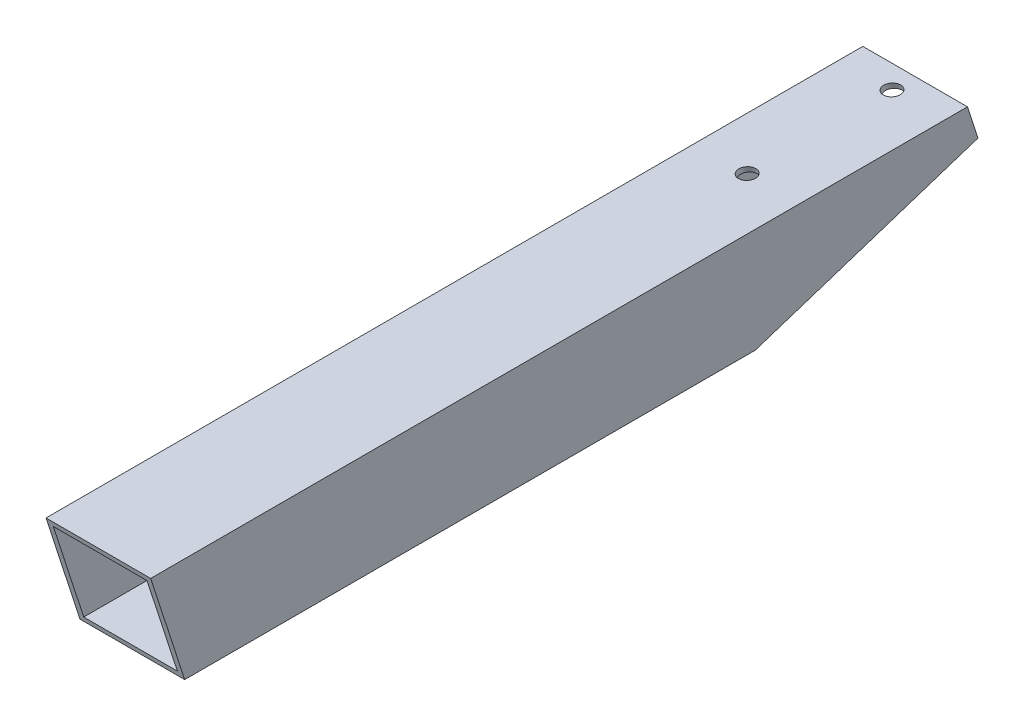
ISO-10303-21;
HEADER;
FILE_DESCRIPTION(('STEP AP214'),'2;1');
FILE_NAME('part.step','',(''),(''),'','','');
FILE_SCHEMA(('AUTOMOTIVE_DESIGN { 1 0 10303 214 1 1 1 1 }'));
ENDSEC;
DATA;
#1=APPLICATION_CONTEXT('core data for automotive mechanical design processes');
#2=APPLICATION_PROTOCOL_DEFINITION('international standard','automotive_design',2000,#1);
#3=PRODUCT_CONTEXT('',#1,'mechanical');
#4=PRODUCT('Part','Part','',(#3));
#5=PRODUCT_RELATED_PRODUCT_CATEGORY('part','',(#4));
#6=PRODUCT_DEFINITION_FORMATION('','',#4);
#7=PRODUCT_DEFINITION_CONTEXT('part definition',#1,'design');
#8=PRODUCT_DEFINITION('design','',#6,#7);
#9=PRODUCT_DEFINITION_SHAPE('','',#8);
#10=(LENGTH_UNIT() NAMED_UNIT(*) SI_UNIT(.MILLI.,.METRE.));
#11=(NAMED_UNIT(*) PLANE_ANGLE_UNIT() SI_UNIT($,.RADIAN.));
#12=(NAMED_UNIT(*) SI_UNIT($,.STERADIAN.) SOLID_ANGLE_UNIT());
#13=UNCERTAINTY_MEASURE_WITH_UNIT(LENGTH_MEASURE(1.E-05),#10,'distance_accuracy_value','');
#14=(GEOMETRIC_REPRESENTATION_CONTEXT(3) GLOBAL_UNCERTAINTY_ASSIGNED_CONTEXT((#13)) GLOBAL_UNIT_ASSIGNED_CONTEXT((#10,
#11,#12)) REPRESENTATION_CONTEXT('',''));
#15=CARTESIAN_POINT('',(0.,0.,0.));
#16=DIRECTION('',(0.,0.,1.));
#17=DIRECTION('',(1.,0.,0.));
#18=AXIS2_PLACEMENT_3D('',#15,#16,#17);
#19=CARTESIAN_POINT('',(9.5,9.5,260.));
#20=DIRECTION('',(-1.,0.,0.));
#21=DIRECTION('',(0.,0.,1.));
#22=AXIS2_PLACEMENT_3D('',#19,#20,#21);
#23=PLANE('',#22);
#24=DIRECTION('',(0.,-0.309016994374942,0.951056516295155));
#25=VECTOR('',#24,1.);
#26=CARTESIAN_POINT('',(9.5,9.5,0.));
#27=LINE('',#26,#25);
#28=CARTESIAN_POINT('',(9.5,3.62867710687612,18.0700738096079));
#29=VERTEX_POINT('',#28);
#30=CARTESIAN_POINT('',(9.5,-9.5,58.475987206331));
#31=VERTEX_POINT('',#30);
#32=EDGE_CURVE('E127',#29,#31,#27,.T.);
#33=ORIENTED_EDGE('',*,*,#32,.F.);
#34=DIRECTION('',(0.,-0.951056516295155,-0.309016994374942));
#35=VECTOR('',#34,1.);
#36=CARTESIAN_POINT('',(9.5,53.0713962068668,34.1349870805055));
#37=LINE('',#36,#35);
#38=CARTESIAN_POINT('',(9.5,9.50000000000002,19.977782260527));
#39=VERTEX_POINT('',#38);
#40=EDGE_CURVE('E46',#39,#29,#37,.T.);
#41=ORIENTED_EDGE('',*,*,#40,.F.);
#42=DIRECTION('',(0.,0.,-1.));
#43=VECTOR('',#42,1.);
#44=CARTESIAN_POINT('',(9.5,9.5,260.));
#45=LINE('',#44,#43);
#46=CARTESIAN_POINT('',(9.5,9.5,168.233955878122));
#47=VERTEX_POINT('',#46);
#48=EDGE_CURVE('E157',#47,#39,#45,.T.);
#49=ORIENTED_EDGE('',*,*,#48,.F.);
#50=DIRECTION('',(0.,0.951056516295156,0.309016994374941));
#51=VECTOR('',#50,1.);
#52=CARTESIAN_POINT('',(9.5,10.4737170732223,168.550335733771));
#53=LINE('',#52,#51);
#54=CARTESIAN_POINT('',(9.5,-9.5,162.060481649697));
#55=VERTEX_POINT('',#54);
#56=EDGE_CURVE('E174',#55,#47,#53,.T.);
#57=ORIENTED_EDGE('',*,*,#56,.F.);
#58=DIRECTION('',(0.,0.,-1.));
#59=VECTOR('',#58,1.);
#60=CARTESIAN_POINT('',(9.5,-9.5,260.));
#61=LINE('',#60,#59);
#62=EDGE_CURVE('E144',#55,#31,#61,.T.);
#63=ORIENTED_EDGE('',*,*,#62,.T.);
#64=EDGE_LOOP('',(#33,#41,#49,#57,#63));
#65=FACE_BOUND('',#64,.T.);
#66=ADVANCED_FACE('F32',(#65),#23,.F.);
#67=CARTESIAN_POINT('',(-9.5,9.5,260.));
#68=DIRECTION('',(0.,-1.,0.));
#69=DIRECTION('',(0.,0.,-1.));
#70=AXIS2_PLACEMENT_3D('',#67,#68,#69);
#71=PLANE('',#70);
#72=CARTESIAN_POINT('',(0.,9.5,24.1836311574801));
#73=DIRECTION('',(0.,-1.,0.));
#74=DIRECTION('',(0.,0.,-1.));
#75=AXIS2_PLACEMENT_3D('',#72,#73,#74);
#76=ELLIPSE('',#75,1.5771933363574,1.5);
#77=CARTESIAN_POINT('',(0.,9.5,22.6064378211227));
#78=VERTEX_POINT('',#77);
#79=EDGE_CURVE('E170',#78,#78,#76,.F.);
#80=ORIENTED_EDGE('',*,*,#79,.F.);
#81=EDGE_LOOP('',(#80));
#82=FACE_BOUND('',#81,.T.);
#83=CARTESIAN_POINT('',(0.,9.5,50.4701867634367));
#84=DIRECTION('',(0.,-1.,0.));
#85=DIRECTION('',(0.,0.,-1.));
#86=AXIS2_PLACEMENT_3D('',#83,#84,#85);
#87=ELLIPSE('',#86,1.5771933363574,1.5);
#88=CARTESIAN_POINT('',(0.,9.5,48.8929934270793));
#89=VERTEX_POINT('',#88);
#90=EDGE_CURVE('E166',#89,#89,#87,.F.);
#91=ORIENTED_EDGE('',*,*,#90,.F.);
#92=EDGE_LOOP('',(#91));
#93=FACE_BOUND('',#92,.T.);
#94=ORIENTED_EDGE('',*,*,#48,.T.);
#95=DIRECTION('',(-1.,0.,0.));
#96=VECTOR('',#95,1.);
#97=CARTESIAN_POINT('',(-9.49999999999995,9.5,19.977782260527));
#98=LINE('',#97,#96);
#99=CARTESIAN_POINT('',(-9.5,9.50000000000003,19.977782260527));
#100=VERTEX_POINT('',#99);
#101=EDGE_CURVE('E167',#39,#100,#98,.T.);
#102=ORIENTED_EDGE('',*,*,#101,.T.);
#103=DIRECTION('',(0.,0.,-1.));
#104=VECTOR('',#103,1.);
#105=CARTESIAN_POINT('',(-9.5,9.5,260.));
#106=LINE('',#105,#104);
#107=CARTESIAN_POINT('',(-9.5,9.5,168.233955878122));
#108=VERTEX_POINT('',#107);
#109=EDGE_CURVE('E121',#108,#100,#106,.T.);
#110=ORIENTED_EDGE('',*,*,#109,.F.);
#111=DIRECTION('',(1.,0.,0.));
#112=VECTOR('',#111,1.);
#113=CARTESIAN_POINT('',(-9.5,9.5,168.233955878122));
#114=LINE('',#113,#112);
#115=EDGE_CURVE('E131',#108,#47,#114,.T.);
#116=ORIENTED_EDGE('',*,*,#115,.T.);
#117=EDGE_LOOP('',(#94,#102,#110,#116));
#118=FACE_BOUND('',#117,.T.);
#119=ADVANCED_FACE('F196',(#82,#93,#118),#71,.F.);
#120=CARTESIAN_POINT('',(-9.5,9.5,260.));
#121=DIRECTION('',(1.,0.,0.));
#122=DIRECTION('',(0.,1.,0.));
#123=AXIS2_PLACEMENT_3D('',#120,#121,#122);
#124=PLANE('',#123);
#125=ORIENTED_EDGE('',*,*,#109,.T.);
#126=DIRECTION('',(0.,-0.951056516295155,-0.309016994374942));
#127=VECTOR('',#126,1.);
#128=CARTESIAN_POINT('',(-9.5,53.0713962068668,34.1349870805055));
#129=LINE('',#128,#127);
#130=CARTESIAN_POINT('',(-9.5,3.62867710687612,18.0700738096079));
#131=VERTEX_POINT('',#130);
#132=EDGE_CURVE('E107',#100,#131,#129,.T.);
#133=ORIENTED_EDGE('',*,*,#132,.T.);
#134=DIRECTION('',(0.,-0.309016994374942,0.951056516295155));
#135=VECTOR('',#134,1.);
#136=CARTESIAN_POINT('',(-9.5,9.5,0.));
#137=LINE('',#136,#135);
#138=CARTESIAN_POINT('',(-9.5,-9.5,58.475987206331));
#139=VERTEX_POINT('',#138);
#140=EDGE_CURVE('E118',#131,#139,#137,.T.);
#141=ORIENTED_EDGE('',*,*,#140,.T.);
#142=DIRECTION('',(0.,0.,-1.));
#143=VECTOR('',#142,1.);
#144=CARTESIAN_POINT('',(-9.5,-9.5,260.));
#145=LINE('',#144,#143);
#146=CARTESIAN_POINT('',(-9.5,-9.5,162.060481649697));
#147=VERTEX_POINT('',#146);
#148=EDGE_CURVE('E154',#147,#139,#145,.T.);
#149=ORIENTED_EDGE('',*,*,#148,.F.);
#150=DIRECTION('',(0.,0.951056516295156,0.309016994374941));
#151=VECTOR('',#150,1.);
#152=CARTESIAN_POINT('',(-9.5,59.6111960038957,184.516070461575));
#153=LINE('',#152,#151);
#154=EDGE_CURVE('E54',#147,#108,#153,.T.);
#155=ORIENTED_EDGE('',*,*,#154,.T.);
#156=EDGE_LOOP('',(#125,#133,#141,#149,#155));
#157=FACE_BOUND('',#156,.T.);
#158=ADVANCED_FACE('F116',(#157),#124,.F.);
#159=CARTESIAN_POINT('',(-9.5,-9.5,260.));
#160=DIRECTION('',(0.,1.,0.));
#161=DIRECTION('',(-1.,0.,0.));
#162=AXIS2_PLACEMENT_3D('',#159,#160,#161);
#163=PLANE('',#162);
#164=ORIENTED_EDGE('',*,*,#62,.F.);
#165=DIRECTION('',(-1.,0.,0.));
#166=VECTOR('',#165,1.);
#167=CARTESIAN_POINT('',(-9.5,-9.5,162.060481649697));
#168=LINE('',#167,#166);
#169=EDGE_CURVE('E190',#55,#147,#168,.T.);
#170=ORIENTED_EDGE('',*,*,#169,.T.);
#171=ORIENTED_EDGE('',*,*,#148,.T.);
#172=DIRECTION('',(1.,0.,0.));
#173=VECTOR('',#172,1.);
#174=CARTESIAN_POINT('',(-9.5,-9.5,58.475987206331));
#175=LINE('',#174,#173);
#176=EDGE_CURVE('E126',#139,#31,#175,.T.);
#177=ORIENTED_EDGE('',*,*,#176,.T.);
#178=EDGE_LOOP('',(#164,#170,#171,#177));
#179=FACE_BOUND('',#178,.T.);
#180=ADVANCED_FACE('F229',(#179),#163,.F.);
#181=CARTESIAN_POINT('',(8.5,9.5,260.));
#182=DIRECTION('',(-1.,0.,0.));
#183=DIRECTION('',(0.,0.,1.));
#184=AXIS2_PLACEMENT_3D('',#181,#182,#183);
#185=PLANE('',#184);
#186=DIRECTION('',(0.,0.951056516295155,0.309016994374942));
#187=VECTOR('',#186,1.);
#188=CARTESIAN_POINT('',(8.5,80.0407599048963,42.8978645408639));
#189=LINE('',#188,#187);
#190=CARTESIAN_POINT('',(8.49999999999999,3.62867710687612,18.0700738096079));
#191=VERTEX_POINT('',#190);
#192=CARTESIAN_POINT('',(8.49999999999999,8.5,19.6528625642941));
#193=VERTEX_POINT('',#192);
#194=EDGE_CURVE('E206',#191,#193,#189,.T.);
#195=ORIENTED_EDGE('',*,*,#194,.F.);
#196=DIRECTION('',(0.,0.309016994374942,-0.951056516295156));
#197=VECTOR('',#196,1.);
#198=CARTESIAN_POINT('',(8.5,-66.9120827980202,235.172209268744));
#199=LINE('',#198,#197);
#200=CARTESIAN_POINT('',(8.49999999999999,-8.5,55.3983036691557));
#201=VERTEX_POINT('',#200);
#202=EDGE_CURVE('E137',#201,#191,#199,.T.);
#203=ORIENTED_EDGE('',*,*,#202,.F.);
#204=DIRECTION('',(0.,0.,-1.));
#205=VECTOR('',#204,1.);
#206=CARTESIAN_POINT('',(8.5,-8.49999999999999,260.));
#207=LINE('',#206,#205);
#208=CARTESIAN_POINT('',(8.5,-8.49999999999999,162.38540134593));
#209=VERTEX_POINT('',#208);
#210=EDGE_CURVE('E140',#209,#201,#207,.T.);
#211=ORIENTED_EDGE('',*,*,#210,.F.);
#212=DIRECTION('',(0.,-0.951056516295156,-0.309016994374941));
#213=VECTOR('',#212,1.);
#214=CARTESIAN_POINT('',(8.5,36.4693636980295,176.996833338481));
#215=LINE('',#214,#213);
#216=CARTESIAN_POINT('',(8.49999999999999,8.5,167.90903618189));
#217=VERTEX_POINT('',#216);
#218=EDGE_CURVE('E189',#217,#209,#215,.T.);
#219=ORIENTED_EDGE('',*,*,#218,.F.);
#220=DIRECTION('',(0.,0.,-1.));
#221=VECTOR('',#220,1.);
#222=CARTESIAN_POINT('',(8.5,8.5,260.));
#223=LINE('',#222,#221);
#224=EDGE_CURVE('E141',#217,#193,#223,.T.);
#225=ORIENTED_EDGE('',*,*,#224,.T.);
#226=EDGE_LOOP('',(#195,#203,#211,#219,#225));
#227=FACE_BOUND('',#226,.T.);
#228=ADVANCED_FACE('F217',(#227),#185,.T.);
#229=CARTESIAN_POINT('',(-9.5,8.5,260.));
#230=DIRECTION('',(0.,-1.,0.));
#231=DIRECTION('',(0.,0.,-1.));
#232=AXIS2_PLACEMENT_3D('',#229,#230,#231);
#233=PLANE('',#232);
#234=DIRECTION('',(-1.,0.,0.));
#235=VECTOR('',#234,1.);
#236=CARTESIAN_POINT('',(-9.49999999999995,8.5,19.6528625642941));
#237=LINE('',#236,#235);
#238=CARTESIAN_POINT('',(-8.5,8.50000000000001,19.6528625642942));
#239=VERTEX_POINT('',#238);
#240=EDGE_CURVE('E205',#193,#239,#237,.T.);
#241=ORIENTED_EDGE('',*,*,#240,.F.);
#242=ORIENTED_EDGE('',*,*,#224,.F.);
#243=DIRECTION('',(1.,0.,0.));
#244=VECTOR('',#243,1.);
#245=CARTESIAN_POINT('',(-9.5,8.5,167.90903618189));
#246=LINE('',#245,#244);
#247=CARTESIAN_POINT('',(-8.5,8.5,167.90903618189));
#248=VERTEX_POINT('',#247);
#249=EDGE_CURVE('E187',#248,#217,#246,.T.);
#250=ORIENTED_EDGE('',*,*,#249,.F.);
#251=DIRECTION('',(0.,0.,-1.));
#252=VECTOR('',#251,1.);
#253=CARTESIAN_POINT('',(-8.5,8.5,260.));
#254=LINE('',#253,#252);
#255=EDGE_CURVE('E145',#248,#239,#254,.T.);
#256=ORIENTED_EDGE('',*,*,#255,.T.);
#257=EDGE_LOOP('',(#241,#242,#250,#256));
#258=FACE_BOUND('',#257,.T.);
#259=CARTESIAN_POINT('',(0.,8.5,23.8587114612472));
#260=DIRECTION('',(0.,-1.,0.));
#261=DIRECTION('',(0.,0.,-1.));
#262=AXIS2_PLACEMENT_3D('',#259,#260,#261);
#263=ELLIPSE('',#262,1.5771933363574,1.5);
#264=CARTESIAN_POINT('',(0.,8.5,22.2815181248898));
#265=VERTEX_POINT('',#264);
#266=EDGE_CURVE('E168',#265,#265,#263,.F.);
#267=ORIENTED_EDGE('',*,*,#266,.T.);
#268=EDGE_LOOP('',(#267));
#269=FACE_BOUND('',#268,.T.);
#270=CARTESIAN_POINT('',(0.,8.5,50.1452670672038));
#271=DIRECTION('',(0.,-1.,0.));
#272=DIRECTION('',(0.,0.,-1.));
#273=AXIS2_PLACEMENT_3D('',#270,#271,#272);
#274=ELLIPSE('',#273,1.5771933363574,1.5);
#275=CARTESIAN_POINT('',(0.,8.5,48.5680737308464));
#276=VERTEX_POINT('',#275);
#277=EDGE_CURVE('E164',#276,#276,#274,.F.);
#278=ORIENTED_EDGE('',*,*,#277,.T.);
#279=EDGE_LOOP('',(#278));
#280=FACE_BOUND('',#279,.T.);
#281=ADVANCED_FACE('F213',(#258,#269,#280),#233,.T.);
#282=CARTESIAN_POINT('',(-8.5,9.5,260.));
#283=DIRECTION('',(1.,0.,0.));
#284=DIRECTION('',(0.,1.,0.));
#285=AXIS2_PLACEMENT_3D('',#282,#283,#284);
#286=PLANE('',#285);
#287=DIRECTION('',(0.,-0.951056516295155,-0.309016994374942));
#288=VECTOR('',#287,1.);
#289=CARTESIAN_POINT('',(-8.50000000000001,80.0407599048963,42.8978645408639));
#290=LINE('',#289,#288);
#291=CARTESIAN_POINT('',(-8.5,3.62867710687612,18.0700738096079));
#292=VERTEX_POINT('',#291);
#293=EDGE_CURVE('E110',#239,#292,#290,.T.);
#294=ORIENTED_EDGE('',*,*,#293,.F.);
#295=ORIENTED_EDGE('',*,*,#255,.F.);
#296=DIRECTION('',(0.,0.951056516295156,0.309016994374941));
#297=VECTOR('',#296,1.);
#298=CARTESIAN_POINT('',(-8.50000000000001,36.4693636980295,176.996833338481));
#299=LINE('',#298,#297);
#300=CARTESIAN_POINT('',(-8.5,-8.5,162.38540134593));
#301=VERTEX_POINT('',#300);
#302=EDGE_CURVE('E184',#301,#248,#299,.T.);
#303=ORIENTED_EDGE('',*,*,#302,.F.);
#304=DIRECTION('',(0.,0.,-1.));
#305=VECTOR('',#304,1.);
#306=CARTESIAN_POINT('',(-8.5,-8.5,260.));
#307=LINE('',#306,#305);
#308=CARTESIAN_POINT('',(-8.5,-8.5,55.3983036691557));
#309=VERTEX_POINT('',#308);
#310=EDGE_CURVE('E147',#301,#309,#307,.T.);
#311=ORIENTED_EDGE('',*,*,#310,.T.);
#312=DIRECTION('',(0.,-0.309016994374942,0.951056516295156));
#313=VECTOR('',#312,1.);
#314=CARTESIAN_POINT('',(-8.49999999999999,-66.9120827980202,235.172209268744));
#315=LINE('',#314,#313);
#316=EDGE_CURVE('E129',#292,#309,#315,.T.);
#317=ORIENTED_EDGE('',*,*,#316,.F.);
#318=EDGE_LOOP('',(#294,#295,#303,#311,#317));
#319=FACE_BOUND('',#318,.T.);
#320=ADVANCED_FACE('F228',(#319),#286,.T.);
#321=CARTESIAN_POINT('',(-9.5,-8.5,260.));
#322=DIRECTION('',(0.,1.,0.));
#323=DIRECTION('',(-1.,0.,0.));
#324=AXIS2_PLACEMENT_3D('',#321,#322,#323);
#325=PLANE('',#324);
#326=DIRECTION('',(-1.,0.,0.));
#327=VECTOR('',#326,1.);
#328=CARTESIAN_POINT('',(-9.5,-8.5,162.38540134593));
#329=LINE('',#328,#327);
#330=EDGE_CURVE('E39',#209,#301,#329,.T.);
#331=ORIENTED_EDGE('',*,*,#330,.F.);
#332=ORIENTED_EDGE('',*,*,#210,.T.);
#333=DIRECTION('',(1.,0.,0.));
#334=VECTOR('',#333,1.);
#335=CARTESIAN_POINT('',(-9.49999999999994,-8.5,55.3983036691557));
#336=LINE('',#335,#334);
#337=EDGE_CURVE('E160',#309,#201,#336,.T.);
#338=ORIENTED_EDGE('',*,*,#337,.F.);
#339=ORIENTED_EDGE('',*,*,#310,.F.);
#340=EDGE_LOOP('',(#331,#332,#338,#339));
#341=FACE_BOUND('',#340,.T.);
#342=ADVANCED_FACE('F225',(#341),#325,.T.);
#343=CARTESIAN_POINT('',(-9.5,9.5,0.));
#344=DIRECTION('',(0.,0.951056516295155,0.309016994374942));
#345=DIRECTION('',(0.,-0.309016994374942,0.951056516295156));
#346=AXIS2_PLACEMENT_3D('',#343,#344,#345);
#347=PLANE('',#346);
#348=ORIENTED_EDGE('',*,*,#140,.F.);
#349=DIRECTION('',(1.,0.,0.));
#350=VECTOR('',#349,1.);
#351=CARTESIAN_POINT('',(-9.50000000000001,3.62867710687612,18.0700738096079));
#352=LINE('',#351,#350);
#353=EDGE_CURVE('E11',#131,#292,#352,.T.);
#354=ORIENTED_EDGE('',*,*,#353,.T.);
#355=ORIENTED_EDGE('',*,*,#316,.T.);
#356=ORIENTED_EDGE('',*,*,#337,.T.);
#357=ORIENTED_EDGE('',*,*,#202,.T.);
#358=DIRECTION('',(-1.,0.,0.));
#359=VECTOR('',#358,1.);
#360=CARTESIAN_POINT('',(9.5,3.62867710687612,18.0700738096079));
#361=LINE('',#360,#359);
#362=EDGE_CURVE('E200',#29,#191,#361,.T.);
#363=ORIENTED_EDGE('',*,*,#362,.F.);
#364=ORIENTED_EDGE('',*,*,#32,.T.);
#365=ORIENTED_EDGE('',*,*,#176,.F.);
#366=EDGE_LOOP('',(#348,#354,#355,#356,#357,#363,#364,#365));
#367=FACE_BOUND('',#366,.T.);
#368=ADVANCED_FACE('F124',(#367),#347,.F.);
#369=CARTESIAN_POINT('',(-9.5,10.4737170732223,168.550335733771));
#370=DIRECTION('',(0.,0.309016994374941,-0.951056516295156));
#371=DIRECTION('',(0.,0.951056516295156,0.309016994374941));
#372=AXIS2_PLACEMENT_3D('',#369,#370,#371);
#373=PLANE('',#372);
#374=ORIENTED_EDGE('',*,*,#218,.T.);
#375=ORIENTED_EDGE('',*,*,#330,.T.);
#376=ORIENTED_EDGE('',*,*,#302,.T.);
#377=ORIENTED_EDGE('',*,*,#249,.T.);
#378=EDGE_LOOP('',(#374,#375,#376,#377));
#379=FACE_BOUND('',#378,.T.);
#380=ORIENTED_EDGE('',*,*,#154,.F.);
#381=ORIENTED_EDGE('',*,*,#169,.F.);
#382=ORIENTED_EDGE('',*,*,#56,.T.);
#383=ORIENTED_EDGE('',*,*,#115,.F.);
#384=EDGE_LOOP('',(#380,#381,#382,#383));
#385=FACE_BOUND('',#384,.T.);
#386=ADVANCED_FACE('F221',(#379,#385),#373,.F.);
#387=CARTESIAN_POINT('',(0.,44.1099033699935,61.715626053065));
#388=DIRECTION('',(0.,-0.951056516295155,-0.309016994374942));
#389=DIRECTION('',(0.,0.309016994374942,-0.951056516295156));
#390=AXIS2_PLACEMENT_3D('',#387,#388,#389);
#391=CYLINDRICAL_SURFACE('',#390,1.5);
#392=ORIENTED_EDGE('',*,*,#277,.F.);
#393=EDGE_LOOP('',(#392));
#394=FACE_BOUND('',#393,.T.);
#395=ORIENTED_EDGE('',*,*,#90,.T.);
#396=EDGE_LOOP('',(#395));
#397=FACE_BOUND('',#396,.T.);
#398=ADVANCED_FACE('F251',(#394,#397),#391,.F.);
#399=CARTESIAN_POINT('',(0.,51.835328229367,37.9392131456861));
#400=DIRECTION('',(0.,-0.951056516295155,-0.309016994374942));
#401=DIRECTION('',(0.,0.309016994374942,-0.951056516295156));
#402=AXIS2_PLACEMENT_3D('',#399,#400,#401);
#403=CYLINDRICAL_SURFACE('',#402,1.5);
#404=ORIENTED_EDGE('',*,*,#266,.F.);
#405=EDGE_LOOP('',(#404));
#406=FACE_BOUND('',#405,.T.);
#407=ORIENTED_EDGE('',*,*,#79,.T.);
#408=EDGE_LOOP('',(#407));
#409=FACE_BOUND('',#408,.T.);
#410=ADVANCED_FACE('F249',(#406,#409),#403,.F.);
#411=CARTESIAN_POINT('',(9.5,53.0713962068668,34.1349870805055));
#412=DIRECTION('',(0.,-0.309016994374942,0.951056516295155));
#413=DIRECTION('',(0.,-0.951056516295155,-0.309016994374942));
#414=AXIS2_PLACEMENT_3D('',#411,#412,#413);
#415=PLANE('',#414);
#416=ORIENTED_EDGE('',*,*,#40,.T.);
#417=ORIENTED_EDGE('',*,*,#362,.T.);
#418=ORIENTED_EDGE('',*,*,#194,.T.);
#419=ORIENTED_EDGE('',*,*,#240,.T.);
#420=ORIENTED_EDGE('',*,*,#293,.T.);
#421=ORIENTED_EDGE('',*,*,#353,.F.);
#422=ORIENTED_EDGE('',*,*,#132,.F.);
#423=ORIENTED_EDGE('',*,*,#101,.F.);
#424=EDGE_LOOP('',(#416,#417,#418,#419,#420,#421,#422,#423));
#425=FACE_BOUND('',#424,.T.);
#426=ADVANCED_FACE('F106',(#425),#415,.F.);
#427=CLOSED_SHELL('',(#66,#119,#158,#180,#228,#281,#320,#342,#368,#386,#398,#410,#426));
#428=MANIFOLD_SOLID_BREP('B2',#427);
#429=ADVANCED_BREP_SHAPE_REPRESENTATION('',(#18,#428),#14);
#430=SHAPE_DEFINITION_REPRESENTATION(#9,#429);
ENDSEC;
END-ISO-10303-21;
